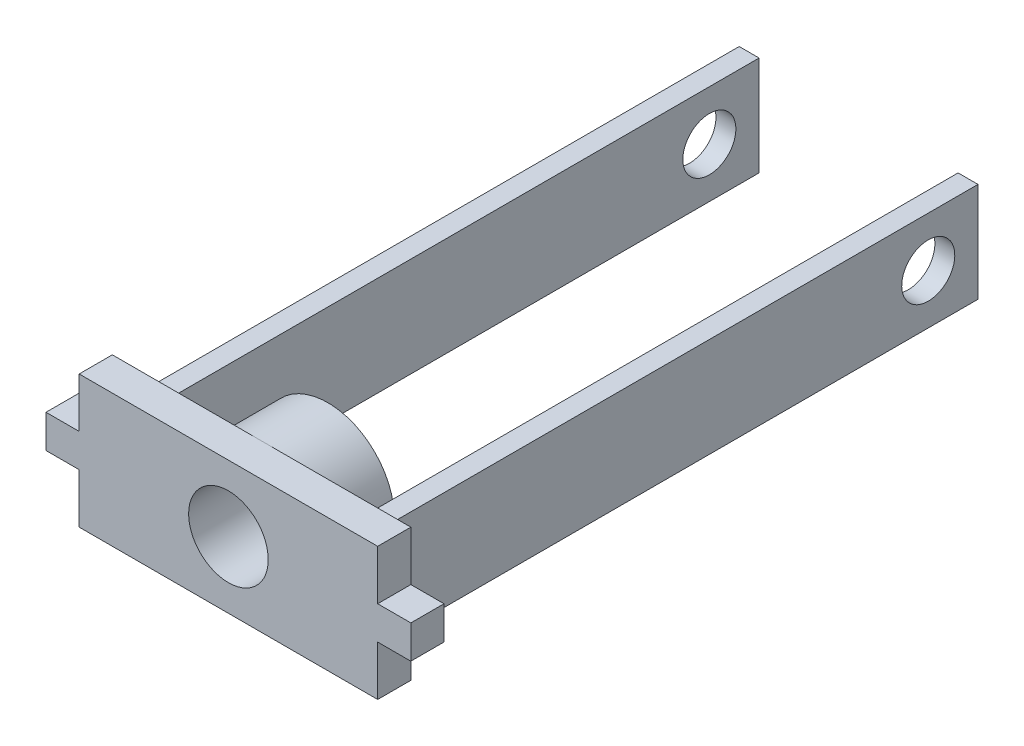
ISO-10303-21;
HEADER;
FILE_DESCRIPTION(('STEP AP214'),'2;1');
FILE_NAME('part.step','',(''),(''),'','','');
FILE_SCHEMA(('AUTOMOTIVE_DESIGN { 1 0 10303 214 1 1 1 1 }'));
ENDSEC;
DATA;
#1=APPLICATION_CONTEXT('core data for automotive mechanical design processes');
#2=APPLICATION_PROTOCOL_DEFINITION('international standard','automotive_design',2000,#1);
#3=PRODUCT_CONTEXT('',#1,'mechanical');
#4=PRODUCT('Part','Part','',(#3));
#5=PRODUCT_RELATED_PRODUCT_CATEGORY('part','',(#4));
#6=PRODUCT_DEFINITION_FORMATION('','',#4);
#7=PRODUCT_DEFINITION_CONTEXT('part definition',#1,'design');
#8=PRODUCT_DEFINITION('design','',#6,#7);
#9=PRODUCT_DEFINITION_SHAPE('','',#8);
#10=(LENGTH_UNIT() NAMED_UNIT(*) SI_UNIT(.MILLI.,.METRE.));
#11=(NAMED_UNIT(*) PLANE_ANGLE_UNIT() SI_UNIT($,.RADIAN.));
#12=(NAMED_UNIT(*) SI_UNIT($,.STERADIAN.) SOLID_ANGLE_UNIT());
#13=UNCERTAINTY_MEASURE_WITH_UNIT(LENGTH_MEASURE(1.E-05),#10,'distance_accuracy_value','');
#14=(GEOMETRIC_REPRESENTATION_CONTEXT(3) GLOBAL_UNCERTAINTY_ASSIGNED_CONTEXT((#13)) GLOBAL_UNIT_ASSIGNED_CONTEXT((#10,
#11,#12)) REPRESENTATION_CONTEXT('',''));
#15=CARTESIAN_POINT('',(0.,0.,0.));
#16=DIRECTION('',(0.,0.,1.));
#17=DIRECTION('',(1.,0.,0.));
#18=AXIS2_PLACEMENT_3D('',#15,#16,#17);
#19=CARTESIAN_POINT('',(0.,0.,0.));
#20=DIRECTION('',(0.,0.,1.));
#21=DIRECTION('',(1.00000000000001,0.,0.));
#22=AXIS2_PLACEMENT_3D('',#19,#20,#21);
#23=PLANE('',#22);
#24=DIRECTION('',(0.,-1.,0.));
#25=VECTOR('',#24,1.);
#26=CARTESIAN_POINT('',(-15.0000000000003,7.50000000000001,0.));
#27=LINE('',#26,#25);
#28=CARTESIAN_POINT('',(-15.0000000000003,7.50000000000001,0.));
#29=VERTEX_POINT('',#28);
#30=CARTESIAN_POINT('',(-15.,-7.49999999999999,0.));
#31=VERTEX_POINT('',#30);
#32=EDGE_CURVE('E233',#29,#31,#27,.T.);
#33=ORIENTED_EDGE('',*,*,#32,.F.);
#34=DIRECTION('',(1.00000000000001,0.,0.));
#35=VECTOR('',#34,1.);
#36=CARTESIAN_POINT('',(-15.0000000000003,7.50000000000001,0.));
#37=LINE('',#36,#35);
#38=CARTESIAN_POINT('',(-18.0000000000003,7.50000000000001,0.));
#39=VERTEX_POINT('',#38);
#40=EDGE_CURVE('E238',#39,#29,#37,.T.);
#41=ORIENTED_EDGE('',*,*,#40,.F.);
#42=DIRECTION('',(0.,1.,0.));
#43=VECTOR('',#42,1.);
#44=CARTESIAN_POINT('',(-18.0000000000003,7.50000000000001,0.));
#45=LINE('',#44,#43);
#46=CARTESIAN_POINT('',(-18.,-7.49999999999999,0.));
#47=VERTEX_POINT('',#46);
#48=EDGE_CURVE('E248',#47,#39,#45,.T.);
#49=ORIENTED_EDGE('',*,*,#48,.F.);
#50=DIRECTION('',(-1.00000000000001,0.,0.));
#51=VECTOR('',#50,1.);
#52=CARTESIAN_POINT('',(-15.,-7.49999999999999,0.));
#53=LINE('',#52,#51);
#54=EDGE_CURVE('E70',#31,#47,#53,.T.);
#55=ORIENTED_EDGE('',*,*,#54,.F.);
#56=EDGE_LOOP('',(#33,#41,#49,#55));
#57=FACE_BOUND('',#56,.T.);
#58=CARTESIAN_POINT('',(0.,0.,0.));
#59=DIRECTION('',(0.,0.,-1.));
#60=DIRECTION('',(-1.00000000000001,0.,0.));
#61=AXIS2_PLACEMENT_3D('',#58,#59,#60);
#62=CIRCLE('',#61,10.);
#63=CARTESIAN_POINT('',(3.05311331771918E-13,-9.99999999999999,0.));
#64=VERTEX_POINT('',#63);
#65=CARTESIAN_POINT('',(0.,9.99999999999999,0.));
#66=VERTEX_POINT('',#65);
#67=EDGE_CURVE('E211',#64,#66,#62,.T.);
#68=ORIENTED_EDGE('',*,*,#67,.F.);
#69=DIRECTION('',(1.00000000000001,0.,0.));
#70=VECTOR('',#69,1.);
#71=CARTESIAN_POINT('',(-22.5,-9.99999999999999,0.));
#72=LINE('',#71,#70);
#73=CARTESIAN_POINT('',(-22.5,-9.99999999999999,0.));
#74=VERTEX_POINT('',#73);
#75=EDGE_CURVE('E192',#74,#64,#72,.T.);
#76=ORIENTED_EDGE('',*,*,#75,.F.);
#77=DIRECTION('',(0.,-1.,0.));
#78=VECTOR('',#77,1.);
#79=CARTESIAN_POINT('',(-22.5000000000003,-2.49999999999999,0.));
#80=LINE('',#79,#78);
#81=CARTESIAN_POINT('',(-22.5000000000003,-2.49999999999999,0.));
#82=VERTEX_POINT('',#81);
#83=EDGE_CURVE('E209',#82,#74,#80,.T.);
#84=ORIENTED_EDGE('',*,*,#83,.F.);
#85=DIRECTION('',(1.00000000000001,0.,0.));
#86=VECTOR('',#85,1.);
#87=CARTESIAN_POINT('',(-22.5000000000003,-2.49999999999999,0.));
#88=LINE('',#87,#86);
#89=CARTESIAN_POINT('',(-27.5000000000006,-2.4999999999997,0.));
#90=VERTEX_POINT('',#89);
#91=EDGE_CURVE('E341',#90,#82,#88,.T.);
#92=ORIENTED_EDGE('',*,*,#91,.F.);
#93=DIRECTION('',(0.,-1.,0.));
#94=VECTOR('',#93,1.);
#95=CARTESIAN_POINT('',(-27.5000000000006,2.50000000000029,0.));
#96=LINE('',#95,#94);
#97=CARTESIAN_POINT('',(-27.5000000000006,2.50000000000029,0.));
#98=VERTEX_POINT('',#97);
#99=EDGE_CURVE('E339',#98,#90,#96,.T.);
#100=ORIENTED_EDGE('',*,*,#99,.F.);
#101=DIRECTION('',(-1.00000000000001,0.,0.));
#102=VECTOR('',#101,1.);
#103=CARTESIAN_POINT('',(-22.5000000000003,2.5,0.));
#104=LINE('',#103,#102);
#105=CARTESIAN_POINT('',(-22.5000000000003,2.5,0.));
#106=VERTEX_POINT('',#105);
#107=EDGE_CURVE('E337',#106,#98,#104,.T.);
#108=ORIENTED_EDGE('',*,*,#107,.F.);
#109=DIRECTION('',(0.,-1.,0.));
#110=VECTOR('',#109,1.);
#111=CARTESIAN_POINT('',(-22.5000000000003,10.,0.));
#112=LINE('',#111,#110);
#113=CARTESIAN_POINT('',(-22.5000000000003,10.,0.));
#114=VERTEX_POINT('',#113);
#115=EDGE_CURVE('E335',#114,#106,#112,.T.);
#116=ORIENTED_EDGE('',*,*,#115,.F.);
#117=DIRECTION('',(-1.00000000000001,0.,0.));
#118=VECTOR('',#117,1.);
#119=CARTESIAN_POINT('',(-22.5000000000003,10.,0.));
#120=LINE('',#119,#118);
#121=EDGE_CURVE('E213',#66,#114,#120,.T.);
#122=ORIENTED_EDGE('',*,*,#121,.F.);
#123=EDGE_LOOP('',(#68,#76,#84,#92,#100,#108,#116,#122));
#124=FACE_BOUND('',#123,.T.);
#125=ADVANCED_FACE('F46',(#57,#124),#23,.F.);
#126=DIRECTION('',(0.,-1.,0.));
#127=VECTOR('',#126,1.);
#128=CARTESIAN_POINT('',(18.,7.49999999999999,0.));
#129=LINE('',#128,#127);
#130=CARTESIAN_POINT('',(18.,7.49999999999999,0.));
#131=VERTEX_POINT('',#130);
#132=CARTESIAN_POINT('',(18.0000000000003,-7.50000000000001,0.));
#133=VERTEX_POINT('',#132);
#134=EDGE_CURVE('E263',#131,#133,#129,.T.);
#135=ORIENTED_EDGE('',*,*,#134,.F.);
#136=DIRECTION('',(1.00000000000001,0.,0.));
#137=VECTOR('',#136,1.);
#138=CARTESIAN_POINT('',(18.,7.49999999999999,0.));
#139=LINE('',#138,#137);
#140=CARTESIAN_POINT('',(15.,7.49999999999999,0.));
#141=VERTEX_POINT('',#140);
#142=EDGE_CURVE('E268',#141,#131,#139,.T.);
#143=ORIENTED_EDGE('',*,*,#142,.F.);
#144=DIRECTION('',(0.,1.,0.));
#145=VECTOR('',#144,1.);
#146=CARTESIAN_POINT('',(15.,7.49999999999999,0.));
#147=LINE('',#146,#145);
#148=CARTESIAN_POINT('',(15.0000000000003,-7.50000000000001,0.));
#149=VERTEX_POINT('',#148);
#150=EDGE_CURVE('E280',#149,#141,#147,.T.);
#151=ORIENTED_EDGE('',*,*,#150,.F.);
#152=DIRECTION('',(-1.00000000000001,0.,0.));
#153=VECTOR('',#152,1.);
#154=CARTESIAN_POINT('',(18.0000000000003,-7.50000000000001,0.));
#155=LINE('',#154,#153);
#156=EDGE_CURVE('E277',#133,#149,#155,.T.);
#157=ORIENTED_EDGE('',*,*,#156,.F.);
#158=EDGE_LOOP('',(#135,#143,#151,#157));
#159=FACE_BOUND('',#158,.T.);
#160=EDGE_CURVE('E62',#66,#64,#62,.T.);
#161=ORIENTED_EDGE('',*,*,#160,.F.);
#162=CARTESIAN_POINT('',(22.5,9.99999999999999,0.));
#163=VERTEX_POINT('',#162);
#164=EDGE_CURVE('E333',#163,#66,#120,.T.);
#165=ORIENTED_EDGE('',*,*,#164,.F.);
#166=DIRECTION('',(0.,1.,0.));
#167=VECTOR('',#166,1.);
#168=CARTESIAN_POINT('',(22.5,9.99999999999999,0.));
#169=LINE('',#168,#167);
#170=CARTESIAN_POINT('',(22.5,2.5,0.));
#171=VERTEX_POINT('',#170);
#172=EDGE_CURVE('E331',#171,#163,#169,.T.);
#173=ORIENTED_EDGE('',*,*,#172,.F.);
#174=DIRECTION('',(-1.00000000000001,0.,0.));
#175=VECTOR('',#174,1.);
#176=CARTESIAN_POINT('',(22.5,2.5,0.));
#177=LINE('',#176,#175);
#178=CARTESIAN_POINT('',(27.5,2.49999999999971,0.));
#179=VERTEX_POINT('',#178);
#180=EDGE_CURVE('E329',#179,#171,#177,.T.);
#181=ORIENTED_EDGE('',*,*,#180,.F.);
#182=DIRECTION('',(0.,1.,0.));
#183=VECTOR('',#182,1.);
#184=CARTESIAN_POINT('',(27.5,2.49999999999971,0.));
#185=LINE('',#184,#183);
#186=CARTESIAN_POINT('',(27.5,-2.50000000000031,0.));
#187=VERTEX_POINT('',#186);
#188=EDGE_CURVE('E327',#187,#179,#185,.T.);
#189=ORIENTED_EDGE('',*,*,#188,.F.);
#190=DIRECTION('',(1.00000000000001,0.,0.));
#191=VECTOR('',#190,1.);
#192=CARTESIAN_POINT('',(22.5,-2.50000000000002,0.));
#193=LINE('',#192,#191);
#194=CARTESIAN_POINT('',(22.5,-2.50000000000002,0.));
#195=VERTEX_POINT('',#194);
#196=EDGE_CURVE('E325',#195,#187,#193,.T.);
#197=ORIENTED_EDGE('',*,*,#196,.F.);
#198=DIRECTION('',(0.,1.,0.));
#199=VECTOR('',#198,1.);
#200=CARTESIAN_POINT('',(22.5,-2.50000000000002,0.));
#201=LINE('',#200,#199);
#202=CARTESIAN_POINT('',(22.5,-10.,0.));
#203=VERTEX_POINT('',#202);
#204=EDGE_CURVE('E208',#203,#195,#201,.T.);
#205=ORIENTED_EDGE('',*,*,#204,.F.);
#206=EDGE_CURVE('E195',#64,#203,#72,.T.);
#207=ORIENTED_EDGE('',*,*,#206,.F.);
#208=EDGE_LOOP('',(#161,#165,#173,#181,#189,#197,#205,#207));
#209=FACE_BOUND('',#208,.T.);
#210=ADVANCED_FACE('F206',(#159,#209),#23,.F.);
#211=CARTESIAN_POINT('',(0.,0.,5.));
#212=DIRECTION('',(0.,0.,1.));
#213=DIRECTION('',(1.00000000000001,0.,0.));
#214=AXIS2_PLACEMENT_3D('',#211,#212,#213);
#215=PLANE('',#214);
#216=DIRECTION('',(0.,1.,0.));
#217=VECTOR('',#216,1.);
#218=CARTESIAN_POINT('',(22.5,-2.50000000000002,5.));
#219=LINE('',#218,#217);
#220=CARTESIAN_POINT('',(22.5,-10.,5.));
#221=VERTEX_POINT('',#220);
#222=CARTESIAN_POINT('',(22.5,-2.50000000000002,5.));
#223=VERTEX_POINT('',#222);
#224=EDGE_CURVE('E203',#221,#223,#219,.T.);
#225=ORIENTED_EDGE('',*,*,#224,.T.);
#226=DIRECTION('',(1.00000000000001,0.,0.));
#227=VECTOR('',#226,1.);
#228=CARTESIAN_POINT('',(22.5,-2.50000000000002,5.));
#229=LINE('',#228,#227);
#230=CARTESIAN_POINT('',(27.5,-2.50000000000031,5.));
#231=VERTEX_POINT('',#230);
#232=EDGE_CURVE('E301',#223,#231,#229,.T.);
#233=ORIENTED_EDGE('',*,*,#232,.T.);
#234=DIRECTION('',(0.,1.,0.));
#235=VECTOR('',#234,1.);
#236=CARTESIAN_POINT('',(27.5,2.49999999999971,5.));
#237=LINE('',#236,#235);
#238=CARTESIAN_POINT('',(27.5,2.49999999999971,5.));
#239=VERTEX_POINT('',#238);
#240=EDGE_CURVE('E303',#231,#239,#237,.T.);
#241=ORIENTED_EDGE('',*,*,#240,.T.);
#242=DIRECTION('',(-1.00000000000001,0.,0.));
#243=VECTOR('',#242,1.);
#244=CARTESIAN_POINT('',(22.5,2.5,5.));
#245=LINE('',#244,#243);
#246=CARTESIAN_POINT('',(22.5,2.5,5.));
#247=VERTEX_POINT('',#246);
#248=EDGE_CURVE('E305',#239,#247,#245,.T.);
#249=ORIENTED_EDGE('',*,*,#248,.T.);
#250=DIRECTION('',(0.,1.,0.));
#251=VECTOR('',#250,1.);
#252=CARTESIAN_POINT('',(22.5,9.99999999999999,5.));
#253=LINE('',#252,#251);
#254=CARTESIAN_POINT('',(22.5,9.99999999999999,5.));
#255=VERTEX_POINT('',#254);
#256=EDGE_CURVE('E307',#247,#255,#253,.T.);
#257=ORIENTED_EDGE('',*,*,#256,.T.);
#258=DIRECTION('',(-1.00000000000001,0.,0.));
#259=VECTOR('',#258,1.);
#260=CARTESIAN_POINT('',(-22.5000000000003,10.,5.));
#261=LINE('',#260,#259);
#262=CARTESIAN_POINT('',(-22.5000000000003,10.,5.));
#263=VERTEX_POINT('',#262);
#264=EDGE_CURVE('E309',#255,#263,#261,.T.);
#265=ORIENTED_EDGE('',*,*,#264,.T.);
#266=DIRECTION('',(0.,-1.,0.));
#267=VECTOR('',#266,1.);
#268=CARTESIAN_POINT('',(-22.5000000000003,10.,5.));
#269=LINE('',#268,#267);
#270=CARTESIAN_POINT('',(-22.5000000000003,2.5,5.));
#271=VERTEX_POINT('',#270);
#272=EDGE_CURVE('E311',#263,#271,#269,.T.);
#273=ORIENTED_EDGE('',*,*,#272,.T.);
#274=DIRECTION('',(-1.00000000000001,0.,0.));
#275=VECTOR('',#274,1.);
#276=CARTESIAN_POINT('',(-22.5000000000003,2.5,5.));
#277=LINE('',#276,#275);
#278=CARTESIAN_POINT('',(-27.5000000000006,2.50000000000029,5.));
#279=VERTEX_POINT('',#278);
#280=EDGE_CURVE('E313',#271,#279,#277,.T.);
#281=ORIENTED_EDGE('',*,*,#280,.T.);
#282=DIRECTION('',(0.,-1.,0.));
#283=VECTOR('',#282,1.);
#284=CARTESIAN_POINT('',(-27.5000000000006,2.50000000000029,5.));
#285=LINE('',#284,#283);
#286=CARTESIAN_POINT('',(-27.5000000000006,-2.4999999999997,5.));
#287=VERTEX_POINT('',#286);
#288=EDGE_CURVE('E315',#279,#287,#285,.T.);
#289=ORIENTED_EDGE('',*,*,#288,.T.);
#290=DIRECTION('',(1.00000000000001,0.,0.));
#291=VECTOR('',#290,1.);
#292=CARTESIAN_POINT('',(-22.5000000000003,-2.49999999999999,5.));
#293=LINE('',#292,#291);
#294=CARTESIAN_POINT('',(-22.5000000000003,-2.49999999999999,5.));
#295=VERTEX_POINT('',#294);
#296=EDGE_CURVE('E317',#287,#295,#293,.T.);
#297=ORIENTED_EDGE('',*,*,#296,.T.);
#298=DIRECTION('',(0.,-1.,0.));
#299=VECTOR('',#298,1.);
#300=CARTESIAN_POINT('',(-22.5000000000003,-2.49999999999999,5.));
#301=LINE('',#300,#299);
#302=CARTESIAN_POINT('',(-22.5,-9.99999999999999,5.));
#303=VERTEX_POINT('',#302);
#304=EDGE_CURVE('E319',#295,#303,#301,.T.);
#305=ORIENTED_EDGE('',*,*,#304,.T.);
#306=DIRECTION('',(1.00000000000001,0.,0.));
#307=VECTOR('',#306,1.);
#308=CARTESIAN_POINT('',(-22.5,-9.99999999999999,5.));
#309=LINE('',#308,#307);
#310=EDGE_CURVE('E321',#303,#221,#309,.T.);
#311=ORIENTED_EDGE('',*,*,#310,.T.);
#312=EDGE_LOOP('',(#225,#233,#241,#249,#257,#265,#273,#281,#289,#297,#305,#311));
#313=FACE_BOUND('',#312,.T.);
#314=CARTESIAN_POINT('',(0.,0.,5.));
#315=DIRECTION('',(0.,0.,1.));
#316=DIRECTION('',(1.00000000000001,0.,0.));
#317=AXIS2_PLACEMENT_3D('',#314,#315,#316);
#318=CIRCLE('',#317,6.);
#319=CARTESIAN_POINT('',(6.00000000000006,0.,5.));
#320=VERTEX_POINT('',#319);
#321=EDGE_CURVE('E296',#320,#320,#318,.T.);
#322=ORIENTED_EDGE('',*,*,#321,.F.);
#323=EDGE_LOOP('',(#322));
#324=FACE_BOUND('',#323,.T.);
#325=ADVANCED_FACE('F390',(#313,#324),#215,.T.);
#326=CARTESIAN_POINT('',(22.5,-2.50000000000002,5.));
#327=DIRECTION('',(-1.00000000000001,0.,0.));
#328=DIRECTION('',(0.,0.,1.));
#329=AXIS2_PLACEMENT_3D('',#326,#327,#328);
#330=PLANE('',#329);
#331=ORIENTED_EDGE('',*,*,#204,.T.);
#332=DIRECTION('',(0.,0.,-1.));
#333=VECTOR('',#332,1.);
#334=CARTESIAN_POINT('',(22.5,-2.50000000000002,5.));
#335=LINE('',#334,#333);
#336=EDGE_CURVE('E13',#223,#195,#335,.T.);
#337=ORIENTED_EDGE('',*,*,#336,.F.);
#338=ORIENTED_EDGE('',*,*,#224,.F.);
#339=DIRECTION('',(0.,0.,-1.));
#340=VECTOR('',#339,1.);
#341=CARTESIAN_POINT('',(22.5,-10.,5.));
#342=LINE('',#341,#340);
#343=EDGE_CURVE('E323',#221,#203,#342,.T.);
#344=ORIENTED_EDGE('',*,*,#343,.T.);
#345=EDGE_LOOP('',(#331,#337,#338,#344));
#346=FACE_BOUND('',#345,.T.);
#347=ADVANCED_FACE('F48',(#346),#330,.F.);
#348=CARTESIAN_POINT('',(22.5,-2.50000000000002,5.));
#349=DIRECTION('',(0.,1.,0.));
#350=DIRECTION('',(0.,0.,1.));
#351=AXIS2_PLACEMENT_3D('',#348,#349,#350);
#352=PLANE('',#351);
#353=ORIENTED_EDGE('',*,*,#196,.T.);
#354=DIRECTION('',(0.,0.,-1.));
#355=VECTOR('',#354,1.);
#356=CARTESIAN_POINT('',(27.5,-2.50000000000031,5.));
#357=LINE('',#356,#355);
#358=EDGE_CURVE('E55',#231,#187,#357,.T.);
#359=ORIENTED_EDGE('',*,*,#358,.F.);
#360=ORIENTED_EDGE('',*,*,#232,.F.);
#361=ORIENTED_EDGE('',*,*,#336,.T.);
#362=EDGE_LOOP('',(#353,#359,#360,#361));
#363=FACE_BOUND('',#362,.T.);
#364=ADVANCED_FACE('F395',(#363),#352,.F.);
#365=CARTESIAN_POINT('',(27.5,2.49999999999971,5.));
#366=DIRECTION('',(-1.00000000000001,0.,0.));
#367=DIRECTION('',(0.,0.,1.));
#368=AXIS2_PLACEMENT_3D('',#365,#366,#367);
#369=PLANE('',#368);
#370=ORIENTED_EDGE('',*,*,#188,.T.);
#371=DIRECTION('',(0.,0.,-1.));
#372=VECTOR('',#371,1.);
#373=CARTESIAN_POINT('',(27.5,2.49999999999971,5.));
#374=LINE('',#373,#372);
#375=EDGE_CURVE('E367',#239,#179,#374,.T.);
#376=ORIENTED_EDGE('',*,*,#375,.F.);
#377=ORIENTED_EDGE('',*,*,#240,.F.);
#378=ORIENTED_EDGE('',*,*,#358,.T.);
#379=EDGE_LOOP('',(#370,#376,#377,#378));
#380=FACE_BOUND('',#379,.T.);
#381=ADVANCED_FACE('F375',(#380),#369,.F.);
#382=CARTESIAN_POINT('',(22.5,2.5,5.));
#383=DIRECTION('',(0.,-1.,0.));
#384=DIRECTION('',(0.,0.,-1.));
#385=AXIS2_PLACEMENT_3D('',#382,#383,#384);
#386=PLANE('',#385);
#387=ORIENTED_EDGE('',*,*,#180,.T.);
#388=DIRECTION('',(0.,0.,-1.));
#389=VECTOR('',#388,1.);
#390=CARTESIAN_POINT('',(22.5,2.5,5.));
#391=LINE('',#390,#389);
#392=EDGE_CURVE('E364',#247,#171,#391,.T.);
#393=ORIENTED_EDGE('',*,*,#392,.F.);
#394=ORIENTED_EDGE('',*,*,#248,.F.);
#395=ORIENTED_EDGE('',*,*,#375,.T.);
#396=EDGE_LOOP('',(#387,#393,#394,#395));
#397=FACE_BOUND('',#396,.T.);
#398=ADVANCED_FACE('F382',(#397),#386,.F.);
#399=CARTESIAN_POINT('',(22.5,9.99999999999999,5.));
#400=DIRECTION('',(-1.00000000000001,0.,0.));
#401=DIRECTION('',(0.,-1.,0.));
#402=AXIS2_PLACEMENT_3D('',#399,#400,#401);
#403=PLANE('',#402);
#404=ORIENTED_EDGE('',*,*,#172,.T.);
#405=DIRECTION('',(0.,0.,-1.));
#406=VECTOR('',#405,1.);
#407=CARTESIAN_POINT('',(22.5,9.99999999999999,5.));
#408=LINE('',#407,#406);
#409=EDGE_CURVE('E361',#255,#163,#408,.T.);
#410=ORIENTED_EDGE('',*,*,#409,.F.);
#411=ORIENTED_EDGE('',*,*,#256,.F.);
#412=ORIENTED_EDGE('',*,*,#392,.T.);
#413=EDGE_LOOP('',(#404,#410,#411,#412));
#414=FACE_BOUND('',#413,.T.);
#415=ADVANCED_FACE('F386',(#414),#403,.F.);
#416=CARTESIAN_POINT('',(-22.5000000000003,10.,5.));
#417=DIRECTION('',(0.,-1.,0.));
#418=DIRECTION('',(0.,0.,-1.));
#419=AXIS2_PLACEMENT_3D('',#416,#417,#418);
#420=PLANE('',#419);
#421=ORIENTED_EDGE('',*,*,#164,.T.);
#422=ORIENTED_EDGE('',*,*,#121,.T.);
#423=DIRECTION('',(0.,0.,-1.));
#424=VECTOR('',#423,1.);
#425=CARTESIAN_POINT('',(-22.5000000000003,10.,5.));
#426=LINE('',#425,#424);
#427=EDGE_CURVE('E358',#263,#114,#426,.T.);
#428=ORIENTED_EDGE('',*,*,#427,.F.);
#429=ORIENTED_EDGE('',*,*,#264,.F.);
#430=ORIENTED_EDGE('',*,*,#409,.T.);
#431=EDGE_LOOP('',(#421,#422,#428,#429,#430));
#432=FACE_BOUND('',#431,.T.);
#433=ADVANCED_FACE('F420',(#432),#420,.F.);
#434=CARTESIAN_POINT('',(-22.5000000000003,10.,5.));
#435=DIRECTION('',(1.00000000000001,0.,0.));
#436=DIRECTION('',(0.,0.,-1.));
#437=AXIS2_PLACEMENT_3D('',#434,#435,#436);
#438=PLANE('',#437);
#439=ORIENTED_EDGE('',*,*,#115,.T.);
#440=DIRECTION('',(0.,0.,-1.));
#441=VECTOR('',#440,1.);
#442=CARTESIAN_POINT('',(-22.5000000000003,2.5,5.));
#443=LINE('',#442,#441);
#444=EDGE_CURVE('E355',#271,#106,#443,.T.);
#445=ORIENTED_EDGE('',*,*,#444,.F.);
#446=ORIENTED_EDGE('',*,*,#272,.F.);
#447=ORIENTED_EDGE('',*,*,#427,.T.);
#448=EDGE_LOOP('',(#439,#445,#446,#447));
#449=FACE_BOUND('',#448,.T.);
#450=ADVANCED_FACE('F417',(#449),#438,.F.);
#451=CARTESIAN_POINT('',(-22.5000000000003,2.5,5.));
#452=DIRECTION('',(0.,-1.,0.));
#453=DIRECTION('',(1.00000000000001,0.,0.));
#454=AXIS2_PLACEMENT_3D('',#451,#452,#453);
#455=PLANE('',#454);
#456=ORIENTED_EDGE('',*,*,#107,.T.);
#457=DIRECTION('',(0.,0.,-1.));
#458=VECTOR('',#457,1.);
#459=CARTESIAN_POINT('',(-27.5000000000006,2.50000000000029,5.));
#460=LINE('',#459,#458);
#461=EDGE_CURVE('E352',#279,#98,#460,.T.);
#462=ORIENTED_EDGE('',*,*,#461,.F.);
#463=ORIENTED_EDGE('',*,*,#280,.F.);
#464=ORIENTED_EDGE('',*,*,#444,.T.);
#465=EDGE_LOOP('',(#456,#462,#463,#464));
#466=FACE_BOUND('',#465,.T.);
#467=ADVANCED_FACE('F414',(#466),#455,.F.);
#468=CARTESIAN_POINT('',(-27.5000000000006,2.50000000000029,5.));
#469=DIRECTION('',(1.00000000000001,0.,0.));
#470=DIRECTION('',(0.,0.,-1.));
#471=AXIS2_PLACEMENT_3D('',#468,#469,#470);
#472=PLANE('',#471);
#473=ORIENTED_EDGE('',*,*,#99,.T.);
#474=DIRECTION('',(0.,0.,-1.));
#475=VECTOR('',#474,1.);
#476=CARTESIAN_POINT('',(-27.5000000000006,-2.4999999999997,5.));
#477=LINE('',#476,#475);
#478=EDGE_CURVE('E349',#287,#90,#477,.T.);
#479=ORIENTED_EDGE('',*,*,#478,.F.);
#480=ORIENTED_EDGE('',*,*,#288,.F.);
#481=ORIENTED_EDGE('',*,*,#461,.T.);
#482=EDGE_LOOP('',(#473,#479,#480,#481));
#483=FACE_BOUND('',#482,.T.);
#484=ADVANCED_FACE('F410',(#483),#472,.F.);
#485=CARTESIAN_POINT('',(-22.5000000000003,-2.49999999999999,5.));
#486=DIRECTION('',(0.,1.,0.));
#487=DIRECTION('',(-1.00000000000001,0.,0.));
#488=AXIS2_PLACEMENT_3D('',#485,#486,#487);
#489=PLANE('',#488);
#490=ORIENTED_EDGE('',*,*,#91,.T.);
#491=DIRECTION('',(0.,0.,-1.));
#492=VECTOR('',#491,1.);
#493=CARTESIAN_POINT('',(-22.5000000000003,-2.49999999999999,5.));
#494=LINE('',#493,#492);
#495=EDGE_CURVE('E346',#295,#82,#494,.T.);
#496=ORIENTED_EDGE('',*,*,#495,.F.);
#497=ORIENTED_EDGE('',*,*,#296,.F.);
#498=ORIENTED_EDGE('',*,*,#478,.T.);
#499=EDGE_LOOP('',(#490,#496,#497,#498));
#500=FACE_BOUND('',#499,.T.);
#501=ADVANCED_FACE('F406',(#500),#489,.F.);
#502=CARTESIAN_POINT('',(-22.5000000000003,-2.49999999999999,5.));
#503=DIRECTION('',(1.00000000000001,0.,0.));
#504=DIRECTION('',(0.,0.,-1.));
#505=AXIS2_PLACEMENT_3D('',#502,#503,#504);
#506=PLANE('',#505);
#507=ORIENTED_EDGE('',*,*,#83,.T.);
#508=DIRECTION('',(0.,0.,-1.));
#509=VECTOR('',#508,1.);
#510=CARTESIAN_POINT('',(-22.5,-9.99999999999999,5.));
#511=LINE('',#510,#509);
#512=EDGE_CURVE('E199',#303,#74,#511,.T.);
#513=ORIENTED_EDGE('',*,*,#512,.F.);
#514=ORIENTED_EDGE('',*,*,#304,.F.);
#515=ORIENTED_EDGE('',*,*,#495,.T.);
#516=EDGE_LOOP('',(#507,#513,#514,#515));
#517=FACE_BOUND('',#516,.T.);
#518=ADVANCED_FACE('F401',(#517),#506,.F.);
#519=CARTESIAN_POINT('',(-22.5,-9.99999999999999,5.));
#520=DIRECTION('',(0.,1.,0.));
#521=DIRECTION('',(0.,0.,1.));
#522=AXIS2_PLACEMENT_3D('',#519,#520,#521);
#523=PLANE('',#522);
#524=ORIENTED_EDGE('',*,*,#75,.T.);
#525=ORIENTED_EDGE('',*,*,#206,.T.);
#526=ORIENTED_EDGE('',*,*,#343,.F.);
#527=ORIENTED_EDGE('',*,*,#310,.F.);
#528=ORIENTED_EDGE('',*,*,#512,.T.);
#529=EDGE_LOOP('',(#524,#525,#526,#527,#528));
#530=FACE_BOUND('',#529,.T.);
#531=ADVANCED_FACE('F193',(#530),#523,.F.);
#532=CARTESIAN_POINT('',(0.,0.,5.));
#533=DIRECTION('',(0.,0.,-1.));
#534=DIRECTION('',(-1.00000000000001,0.,0.));
#535=AXIS2_PLACEMENT_3D('',#532,#533,#534);
#536=CYLINDRICAL_SURFACE('',#535,6.);
#537=ORIENTED_EDGE('',*,*,#321,.T.);
#538=EDGE_LOOP('',(#537));
#539=FACE_BOUND('',#538,.T.);
#540=CARTESIAN_POINT('',(0.,0.,-10.));
#541=DIRECTION('',(0.,0.,-1.));
#542=DIRECTION('',(-1.00000000000001,0.,0.));
#543=AXIS2_PLACEMENT_3D('',#540,#541,#542);
#544=CIRCLE('',#543,6.);
#545=CARTESIAN_POINT('',(-6.00000000000006,0.,-10.));
#546=VERTEX_POINT('',#545);
#547=EDGE_CURVE('E216',#546,#546,#544,.T.);
#548=ORIENTED_EDGE('',*,*,#547,.T.);
#549=EDGE_LOOP('',(#548));
#550=FACE_BOUND('',#549,.T.);
#551=ADVANCED_FACE('F440',(#539,#550),#536,.F.);
#552=CARTESIAN_POINT('',(18.,7.49999999999999,-90.));
#553=DIRECTION('',(-1.00000000000001,0.,0.));
#554=DIRECTION('',(0.,0.,1.));
#555=AXIS2_PLACEMENT_3D('',#552,#553,#554);
#556=PLANE('',#555);
#557=CARTESIAN_POINT('',(18.,0.,-82.5));
#558=DIRECTION('',(1.00000000000001,0.,0.));
#559=DIRECTION('',(0.,1.,0.));
#560=AXIS2_PLACEMENT_3D('',#557,#558,#559);
#561=CIRCLE('',#560,4.00000000000001);
#562=CARTESIAN_POINT('',(18.,4.00000000000001,-82.5));
#563=VERTEX_POINT('',#562);
#564=EDGE_CURVE('E221',#563,#563,#561,.T.);
#565=ORIENTED_EDGE('',*,*,#564,.F.);
#566=EDGE_LOOP('',(#565));
#567=FACE_BOUND('',#566,.T.);
#568=ORIENTED_EDGE('',*,*,#134,.T.);
#569=DIRECTION('',(0.,0.,1.));
#570=VECTOR('',#569,1.);
#571=CARTESIAN_POINT('',(18.0000000000003,-7.50000000000001,-90.));
#572=LINE('',#571,#570);
#573=CARTESIAN_POINT('',(18.0000000000003,-7.50000000000001,-90.));
#574=VERTEX_POINT('',#573);
#575=EDGE_CURVE('E293',#574,#133,#572,.T.);
#576=ORIENTED_EDGE('',*,*,#575,.F.);
#577=DIRECTION('',(0.,-1.,0.));
#578=VECTOR('',#577,1.);
#579=CARTESIAN_POINT('',(18.,7.49999999999999,-90.));
#580=LINE('',#579,#578);
#581=CARTESIAN_POINT('',(18.,7.49999999999999,-90.));
#582=VERTEX_POINT('',#581);
#583=EDGE_CURVE('E264',#582,#574,#580,.T.);
#584=ORIENTED_EDGE('',*,*,#583,.F.);
#585=DIRECTION('',(0.,0.,1.));
#586=VECTOR('',#585,1.);
#587=CARTESIAN_POINT('',(18.,7.49999999999999,-90.));
#588=LINE('',#587,#586);
#589=EDGE_CURVE('E274',#582,#131,#588,.T.);
#590=ORIENTED_EDGE('',*,*,#589,.T.);
#591=EDGE_LOOP('',(#568,#576,#584,#590));
#592=FACE_BOUND('',#591,.T.);
#593=ADVANCED_FACE('F475',(#567,#592),#556,.F.);
#594=CARTESIAN_POINT('',(18.0000000000003,-7.50000000000001,-90.));
#595=DIRECTION('',(0.,1.,0.));
#596=DIRECTION('',(0.,0.,1.));
#597=AXIS2_PLACEMENT_3D('',#594,#595,#596);
#598=PLANE('',#597);
#599=ORIENTED_EDGE('',*,*,#156,.T.);
#600=DIRECTION('',(0.,0.,1.));
#601=VECTOR('',#600,1.);
#602=CARTESIAN_POINT('',(15.0000000000003,-7.50000000000001,-90.));
#603=LINE('',#602,#601);
#604=CARTESIAN_POINT('',(15.0000000000003,-7.50000000000001,-90.));
#605=VERTEX_POINT('',#604);
#606=EDGE_CURVE('E290',#605,#149,#603,.T.);
#607=ORIENTED_EDGE('',*,*,#606,.F.);
#608=DIRECTION('',(-1.00000000000001,0.,0.));
#609=VECTOR('',#608,1.);
#610=CARTESIAN_POINT('',(18.0000000000003,-7.50000000000001,-90.));
#611=LINE('',#610,#609);
#612=EDGE_CURVE('E267',#574,#605,#611,.T.);
#613=ORIENTED_EDGE('',*,*,#612,.F.);
#614=ORIENTED_EDGE('',*,*,#575,.T.);
#615=EDGE_LOOP('',(#599,#607,#613,#614));
#616=FACE_BOUND('',#615,.T.);
#617=ADVANCED_FACE('F483',(#616),#598,.F.);
#618=CARTESIAN_POINT('',(15.,7.49999999999999,-90.));
#619=DIRECTION('',(1.00000000000001,0.,0.));
#620=DIRECTION('',(0.,1.,0.));
#621=AXIS2_PLACEMENT_3D('',#618,#619,#620);
#622=PLANE('',#621);
#623=CARTESIAN_POINT('',(15.,0.,-82.5));
#624=DIRECTION('',(1.00000000000001,0.,0.));
#625=DIRECTION('',(0.,1.,0.));
#626=AXIS2_PLACEMENT_3D('',#623,#624,#625);
#627=CIRCLE('',#626,4.00000000000001);
#628=CARTESIAN_POINT('',(15.,4.00000000000001,-82.5));
#629=VERTEX_POINT('',#628);
#630=EDGE_CURVE('E230',#629,#629,#627,.T.);
#631=ORIENTED_EDGE('',*,*,#630,.T.);
#632=EDGE_LOOP('',(#631));
#633=FACE_BOUND('',#632,.T.);
#634=ORIENTED_EDGE('',*,*,#150,.T.);
#635=DIRECTION('',(0.,0.,1.));
#636=VECTOR('',#635,1.);
#637=CARTESIAN_POINT('',(15.,7.49999999999999,-90.));
#638=LINE('',#637,#636);
#639=CARTESIAN_POINT('',(15.,7.49999999999999,-90.));
#640=VERTEX_POINT('',#639);
#641=EDGE_CURVE('E287',#640,#141,#638,.T.);
#642=ORIENTED_EDGE('',*,*,#641,.F.);
#643=DIRECTION('',(0.,1.,0.));
#644=VECTOR('',#643,1.);
#645=CARTESIAN_POINT('',(15.,7.49999999999999,-90.));
#646=LINE('',#645,#644);
#647=EDGE_CURVE('E270',#605,#640,#646,.T.);
#648=ORIENTED_EDGE('',*,*,#647,.F.);
#649=ORIENTED_EDGE('',*,*,#606,.T.);
#650=EDGE_LOOP('',(#634,#642,#648,#649));
#651=FACE_BOUND('',#650,.T.);
#652=ADVANCED_FACE('F491',(#633,#651),#622,.F.);
#653=CARTESIAN_POINT('',(18.,7.49999999999999,-90.));
#654=DIRECTION('',(0.,-1.,0.));
#655=DIRECTION('',(1.00000000000001,0.,0.));
#656=AXIS2_PLACEMENT_3D('',#653,#654,#655);
#657=PLANE('',#656);
#658=ORIENTED_EDGE('',*,*,#142,.T.);
#659=ORIENTED_EDGE('',*,*,#589,.F.);
#660=DIRECTION('',(1.00000000000001,0.,0.));
#661=VECTOR('',#660,1.);
#662=CARTESIAN_POINT('',(18.,7.49999999999999,-90.));
#663=LINE('',#662,#661);
#664=EDGE_CURVE('E272',#640,#582,#663,.T.);
#665=ORIENTED_EDGE('',*,*,#664,.F.);
#666=ORIENTED_EDGE('',*,*,#641,.T.);
#667=EDGE_LOOP('',(#658,#659,#665,#666));
#668=FACE_BOUND('',#667,.T.);
#669=ADVANCED_FACE('F499',(#668),#657,.F.);
#670=CARTESIAN_POINT('',(0.,0.,-90.));
#671=DIRECTION('',(0.,0.,-1.));
#672=DIRECTION('',(-1.00000000000001,0.,0.));
#673=AXIS2_PLACEMENT_3D('',#670,#671,#672);
#674=PLANE('',#673);
#675=ORIENTED_EDGE('',*,*,#583,.T.);
#676=ORIENTED_EDGE('',*,*,#612,.T.);
#677=ORIENTED_EDGE('',*,*,#647,.T.);
#678=ORIENTED_EDGE('',*,*,#664,.T.);
#679=EDGE_LOOP('',(#675,#676,#677,#678));
#680=FACE_BOUND('',#679,.T.);
#681=ADVANCED_FACE('F507',(#680),#674,.T.);
#682=CARTESIAN_POINT('',(-15.0000000000003,7.50000000000001,-90.));
#683=DIRECTION('',(-1.00000000000001,0.,0.));
#684=DIRECTION('',(0.,-1.,0.));
#685=AXIS2_PLACEMENT_3D('',#682,#683,#684);
#686=PLANE('',#685);
#687=CARTESIAN_POINT('',(-15.0000000000003,0.,-82.5));
#688=DIRECTION('',(-1.00000000000001,0.,0.));
#689=DIRECTION('',(0.,-1.,0.));
#690=AXIS2_PLACEMENT_3D('',#687,#688,#689);
#691=CIRCLE('',#690,4.00000000000001);
#692=CARTESIAN_POINT('',(-15.0000000000003,-3.99999999999999,-82.5));
#693=VERTEX_POINT('',#692);
#694=EDGE_CURVE('E227',#693,#693,#691,.T.);
#695=ORIENTED_EDGE('',*,*,#694,.T.);
#696=EDGE_LOOP('',(#695));
#697=FACE_BOUND('',#696,.T.);
#698=ORIENTED_EDGE('',*,*,#32,.T.);
#699=DIRECTION('',(0.,0.,1.));
#700=VECTOR('',#699,1.);
#701=CARTESIAN_POINT('',(-15.,-7.49999999999999,-90.));
#702=LINE('',#701,#700);
#703=CARTESIAN_POINT('',(-15.,-7.49999999999999,-90.));
#704=VERTEX_POINT('',#703);
#705=EDGE_CURVE('E261',#704,#31,#702,.T.);
#706=ORIENTED_EDGE('',*,*,#705,.F.);
#707=DIRECTION('',(0.,-1.,0.));
#708=VECTOR('',#707,1.);
#709=CARTESIAN_POINT('',(-15.0000000000003,7.50000000000001,-90.));
#710=LINE('',#709,#708);
#711=CARTESIAN_POINT('',(-15.0000000000003,7.50000000000001,-90.));
#712=VERTEX_POINT('',#711);
#713=EDGE_CURVE('E234',#712,#704,#710,.T.);
#714=ORIENTED_EDGE('',*,*,#713,.F.);
#715=DIRECTION('',(0.,0.,1.));
#716=VECTOR('',#715,1.);
#717=CARTESIAN_POINT('',(-15.0000000000003,7.50000000000001,-90.));
#718=LINE('',#717,#716);
#719=EDGE_CURVE('E244',#712,#29,#718,.T.);
#720=ORIENTED_EDGE('',*,*,#719,.T.);
#721=EDGE_LOOP('',(#698,#706,#714,#720));
#722=FACE_BOUND('',#721,.T.);
#723=ADVANCED_FACE('F515',(#697,#722),#686,.F.);
#724=CARTESIAN_POINT('',(-15.,-7.49999999999999,-90.));
#725=DIRECTION('',(0.,1.,0.));
#726=DIRECTION('',(0.,0.,1.));
#727=AXIS2_PLACEMENT_3D('',#724,#725,#726);
#728=PLANE('',#727);
#729=ORIENTED_EDGE('',*,*,#54,.T.);
#730=DIRECTION('',(0.,0.,1.));
#731=VECTOR('',#730,1.);
#732=CARTESIAN_POINT('',(-18.,-7.49999999999999,-90.));
#733=LINE('',#732,#731);
#734=CARTESIAN_POINT('',(-18.,-7.49999999999999,-90.));
#735=VERTEX_POINT('',#734);
#736=EDGE_CURVE('E258',#735,#47,#733,.T.);
#737=ORIENTED_EDGE('',*,*,#736,.F.);
#738=DIRECTION('',(-1.00000000000001,0.,0.));
#739=VECTOR('',#738,1.);
#740=CARTESIAN_POINT('',(-15.,-7.49999999999999,-90.));
#741=LINE('',#740,#739);
#742=EDGE_CURVE('E237',#704,#735,#741,.T.);
#743=ORIENTED_EDGE('',*,*,#742,.F.);
#744=ORIENTED_EDGE('',*,*,#705,.T.);
#745=EDGE_LOOP('',(#729,#737,#743,#744));
#746=FACE_BOUND('',#745,.T.);
#747=ADVANCED_FACE('F523',(#746),#728,.F.);
#748=CARTESIAN_POINT('',(-18.0000000000003,7.50000000000001,-90.));
#749=DIRECTION('',(1.00000000000001,0.,0.));
#750=DIRECTION('',(0.,1.,0.));
#751=AXIS2_PLACEMENT_3D('',#748,#749,#750);
#752=PLANE('',#751);
#753=CARTESIAN_POINT('',(-18.0000000000003,0.,-82.5));
#754=DIRECTION('',(1.00000000000001,0.,0.));
#755=DIRECTION('',(0.,1.,0.));
#756=AXIS2_PLACEMENT_3D('',#753,#754,#755);
#757=CIRCLE('',#756,4.00000000000001);
#758=CARTESIAN_POINT('',(-18.0000000000003,4.00000000000002,-82.5));
#759=VERTEX_POINT('',#758);
#760=EDGE_CURVE('E50',#759,#759,#757,.T.);
#761=ORIENTED_EDGE('',*,*,#760,.T.);
#762=EDGE_LOOP('',(#761));
#763=FACE_BOUND('',#762,.T.);
#764=ORIENTED_EDGE('',*,*,#48,.T.);
#765=DIRECTION('',(0.,0.,1.));
#766=VECTOR('',#765,1.);
#767=CARTESIAN_POINT('',(-18.0000000000003,7.50000000000001,-90.));
#768=LINE('',#767,#766);
#769=CARTESIAN_POINT('',(-18.0000000000003,7.50000000000001,-90.));
#770=VERTEX_POINT('',#769);
#771=EDGE_CURVE('E255',#770,#39,#768,.T.);
#772=ORIENTED_EDGE('',*,*,#771,.F.);
#773=DIRECTION('',(0.,1.,0.));
#774=VECTOR('',#773,1.);
#775=CARTESIAN_POINT('',(-18.0000000000003,7.50000000000001,-90.));
#776=LINE('',#775,#774);
#777=EDGE_CURVE('E240',#735,#770,#776,.T.);
#778=ORIENTED_EDGE('',*,*,#777,.F.);
#779=ORIENTED_EDGE('',*,*,#736,.T.);
#780=EDGE_LOOP('',(#764,#772,#778,#779));
#781=FACE_BOUND('',#780,.T.);
#782=ADVANCED_FACE('F531',(#763,#781),#752,.F.);
#783=CARTESIAN_POINT('',(-15.0000000000003,7.50000000000001,-90.));
#784=DIRECTION('',(0.,-1.,0.));
#785=DIRECTION('',(0.,0.,-1.));
#786=AXIS2_PLACEMENT_3D('',#783,#784,#785);
#787=PLANE('',#786);
#788=ORIENTED_EDGE('',*,*,#40,.T.);
#789=ORIENTED_EDGE('',*,*,#719,.F.);
#790=DIRECTION('',(1.00000000000001,0.,0.));
#791=VECTOR('',#790,1.);
#792=CARTESIAN_POINT('',(-15.0000000000003,7.50000000000001,-90.));
#793=LINE('',#792,#791);
#794=EDGE_CURVE('E242',#770,#712,#793,.T.);
#795=ORIENTED_EDGE('',*,*,#794,.F.);
#796=ORIENTED_EDGE('',*,*,#771,.T.);
#797=EDGE_LOOP('',(#788,#789,#795,#796));
#798=FACE_BOUND('',#797,.T.);
#799=ADVANCED_FACE('F539',(#798),#787,.F.);
#800=CARTESIAN_POINT('',(0.,0.,-90.));
#801=DIRECTION('',(0.,0.,-1.));
#802=DIRECTION('',(-1.00000000000001,0.,0.));
#803=AXIS2_PLACEMENT_3D('',#800,#801,#802);
#804=PLANE('',#803);
#805=ORIENTED_EDGE('',*,*,#713,.T.);
#806=ORIENTED_EDGE('',*,*,#742,.T.);
#807=ORIENTED_EDGE('',*,*,#777,.T.);
#808=ORIENTED_EDGE('',*,*,#794,.T.);
#809=EDGE_LOOP('',(#805,#806,#807,#808));
#810=FACE_BOUND('',#809,.T.);
#811=ADVANCED_FACE('F547',(#810),#804,.T.);
#812=CARTESIAN_POINT('',(-27.5000000000006,3.05311331771918E-13,-82.5));
#813=DIRECTION('',(1.00000000000001,0.,0.));
#814=DIRECTION('',(0.,1.,0.));
#815=AXIS2_PLACEMENT_3D('',#812,#813,#814);
#816=CYLINDRICAL_SURFACE('',#815,4.00000000000001);
#817=ORIENTED_EDGE('',*,*,#760,.F.);
#818=EDGE_LOOP('',(#817));
#819=FACE_BOUND('',#818,.T.);
#820=ORIENTED_EDGE('',*,*,#694,.F.);
#821=EDGE_LOOP('',(#820));
#822=FACE_BOUND('',#821,.T.);
#823=ADVANCED_FACE('F555',(#819,#822),#816,.F.);
#824=ORIENTED_EDGE('',*,*,#564,.T.);
#825=EDGE_LOOP('',(#824));
#826=FACE_BOUND('',#825,.T.);
#827=ORIENTED_EDGE('',*,*,#630,.F.);
#828=EDGE_LOOP('',(#827));
#829=FACE_BOUND('',#828,.T.);
#830=ADVANCED_FACE('F563',(#826,#829),#816,.F.);
#831=CARTESIAN_POINT('',(0.,0.,-10.));
#832=DIRECTION('',(0.,0.,-1.));
#833=DIRECTION('',(-1.00000000000001,0.,0.));
#834=AXIS2_PLACEMENT_3D('',#831,#832,#833);
#835=PLANE('',#834);
#836=CARTESIAN_POINT('',(0.,0.,-10.));
#837=DIRECTION('',(0.,0.,-1.));
#838=DIRECTION('',(-1.00000000000001,0.,0.));
#839=AXIS2_PLACEMENT_3D('',#836,#837,#838);
#840=CIRCLE('',#839,10.);
#841=CARTESIAN_POINT('',(-10.0000000000001,0.,-10.));
#842=VERTEX_POINT('',#841);
#843=EDGE_CURVE('E219',#842,#842,#840,.T.);
#844=ORIENTED_EDGE('',*,*,#843,.T.);
#845=EDGE_LOOP('',(#844));
#846=FACE_BOUND('',#845,.T.);
#847=ORIENTED_EDGE('',*,*,#547,.F.);
#848=EDGE_LOOP('',(#847));
#849=FACE_BOUND('',#848,.T.);
#850=ADVANCED_FACE('F571',(#846,#849),#835,.T.);
#851=CARTESIAN_POINT('',(0.,0.,-10.));
#852=DIRECTION('',(0.,0.,1.));
#853=DIRECTION('',(1.00000000000001,0.,0.));
#854=AXIS2_PLACEMENT_3D('',#851,#852,#853);
#855=CYLINDRICAL_SURFACE('',#854,10.);
#856=ORIENTED_EDGE('',*,*,#843,.F.);
#857=EDGE_LOOP('',(#856));
#858=FACE_BOUND('',#857,.T.);
#859=ORIENTED_EDGE('',*,*,#160,.T.);
#860=ORIENTED_EDGE('',*,*,#67,.T.);
#861=EDGE_LOOP('',(#859,#860));
#862=FACE_BOUND('',#861,.T.);
#863=ADVANCED_FACE('F218',(#858,#862),#855,.T.);
#864=CLOSED_SHELL('',(#125,#210,#325,#347,#364,#381,#398,#415,#433,#450,#467,#484,#501,#518,
#531,#551,#593,#617,#652,#669,#681,#723,#747,#782,#799,#811,#823,#830,#850,#863));
#865=MANIFOLD_SOLID_BREP('B2',#864);
#866=ADVANCED_BREP_SHAPE_REPRESENTATION('',(#18,#865),#14);
#867=SHAPE_DEFINITION_REPRESENTATION(#9,#866);
ENDSEC;
END-ISO-10303-21;
